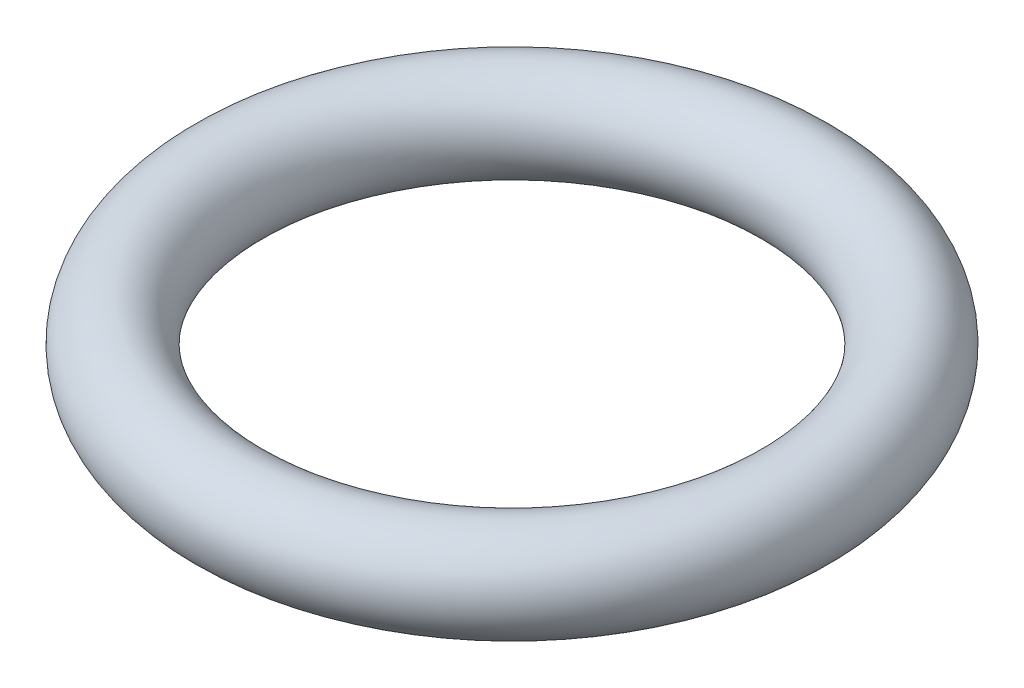
ISO-10303-21;
HEADER;
FILE_DESCRIPTION(('STEP AP214'),'2;1');
FILE_NAME('part.step','',(''),(''),'','','');
FILE_SCHEMA(('AUTOMOTIVE_DESIGN { 1 0 10303 214 1 1 1 1 }'));
ENDSEC;
DATA;
#1=APPLICATION_CONTEXT('core data for automotive mechanical design processes');
#2=APPLICATION_PROTOCOL_DEFINITION('international standard','automotive_design',2000,#1);
#3=PRODUCT_CONTEXT('',#1,'mechanical');
#4=PRODUCT('Part','Part','',(#3));
#5=PRODUCT_RELATED_PRODUCT_CATEGORY('part','',(#4));
#6=PRODUCT_DEFINITION_FORMATION('','',#4);
#7=PRODUCT_DEFINITION_CONTEXT('part definition',#1,'design');
#8=PRODUCT_DEFINITION('design','',#6,#7);
#9=PRODUCT_DEFINITION_SHAPE('','',#8);
#10=(LENGTH_UNIT() NAMED_UNIT(*) SI_UNIT(.MILLI.,.METRE.));
#11=(NAMED_UNIT(*) PLANE_ANGLE_UNIT() SI_UNIT($,.RADIAN.));
#12=(NAMED_UNIT(*) SI_UNIT($,.STERADIAN.) SOLID_ANGLE_UNIT());
#13=UNCERTAINTY_MEASURE_WITH_UNIT(LENGTH_MEASURE(1.E-05),#10,'distance_accuracy_value','');
#14=(GEOMETRIC_REPRESENTATION_CONTEXT(3) GLOBAL_UNCERTAINTY_ASSIGNED_CONTEXT((#13)) GLOBAL_UNIT_ASSIGNED_CONTEXT((#10,
#11,#12)) REPRESENTATION_CONTEXT('',''));
#15=CARTESIAN_POINT('',(0.,0.,0.));
#16=DIRECTION('',(0.,0.,1.));
#17=DIRECTION('',(1.,0.,0.));
#18=AXIS2_PLACEMENT_3D('',#15,#16,#17);
#19=CARTESIAN_POINT('',(0.,0.,0.));
#20=DIRECTION('',(0.,-1.,0.));
#21=DIRECTION('',(0.,0.,-1.));
#22=AXIS2_PLACEMENT_3D('',#19,#20,#21);
#23=TOROIDAL_SURFACE('',#22,152.4,25.4);
#24=CARTESIAN_POINT('',(0.,0.,-177.8));
#25=VERTEX_POINT('',#24);
#26=VERTEX_LOOP('',#25);
#27=FACE_BOUND('',#26,.T.);
#28=ADVANCED_FACE('F35',(#27),#23,.T.);
#29=CLOSED_SHELL('',(#28));
#30=MANIFOLD_SOLID_BREP('B2',#29);
#31=ADVANCED_BREP_SHAPE_REPRESENTATION('',(#18,#30),#14);
#32=SHAPE_DEFINITION_REPRESENTATION(#9,#31);
ENDSEC;
END-ISO-10303-21;
